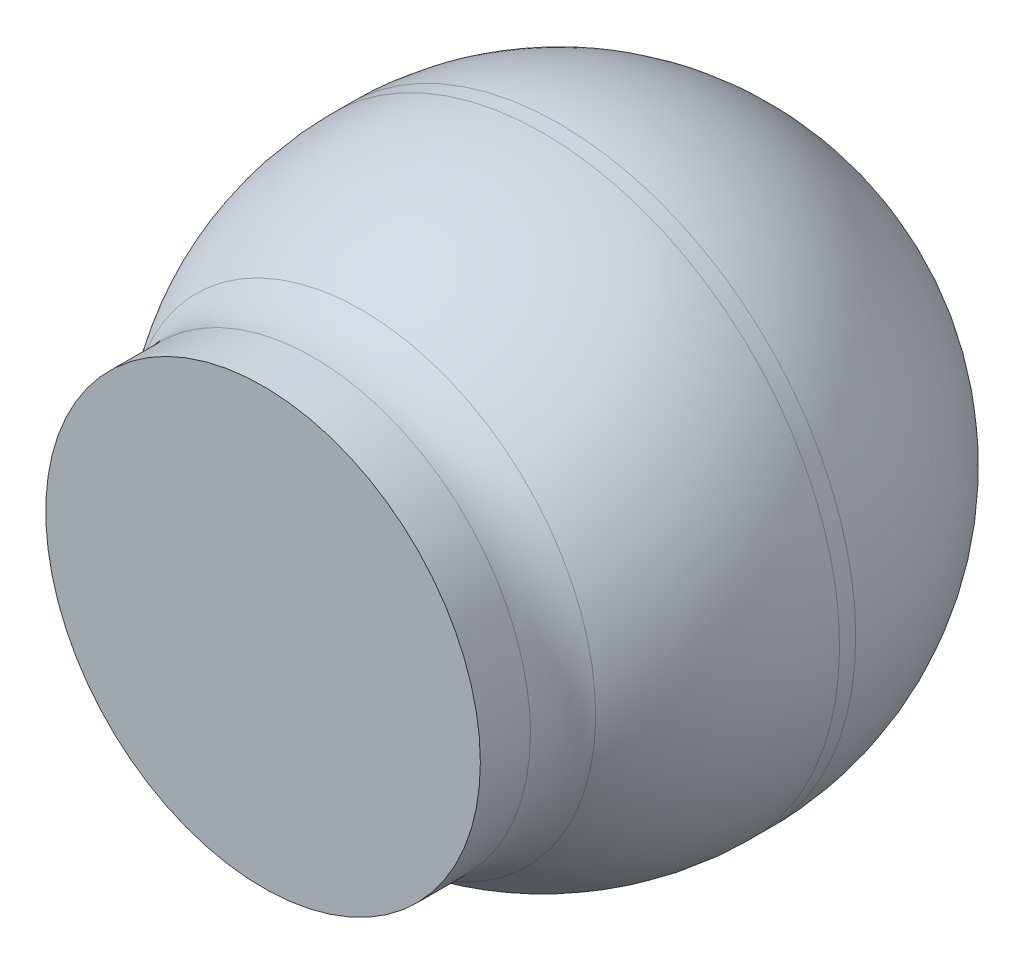
ISO-10303-21;
HEADER;
FILE_DESCRIPTION(('STEP AP214'),'2;1');
FILE_NAME('part.step','',(''),(''),'','','');
FILE_SCHEMA(('AUTOMOTIVE_DESIGN { 1 0 10303 214 1 1 1 1 }'));
ENDSEC;
DATA;
#1=APPLICATION_CONTEXT('core data for automotive mechanical design processes');
#2=APPLICATION_PROTOCOL_DEFINITION('international standard','automotive_design',2000,#1);
#3=PRODUCT_CONTEXT('',#1,'mechanical');
#4=PRODUCT('Part','Part','',(#3));
#5=PRODUCT_RELATED_PRODUCT_CATEGORY('part','',(#4));
#6=PRODUCT_DEFINITION_FORMATION('','',#4);
#7=PRODUCT_DEFINITION_CONTEXT('part definition',#1,'design');
#8=PRODUCT_DEFINITION('design','',#6,#7);
#9=PRODUCT_DEFINITION_SHAPE('','',#8);
#10=(LENGTH_UNIT() NAMED_UNIT(*) SI_UNIT(.MILLI.,.METRE.));
#11=(NAMED_UNIT(*) PLANE_ANGLE_UNIT() SI_UNIT($,.RADIAN.));
#12=(NAMED_UNIT(*) SI_UNIT($,.STERADIAN.) SOLID_ANGLE_UNIT());
#13=UNCERTAINTY_MEASURE_WITH_UNIT(LENGTH_MEASURE(1.E-05),#10,'distance_accuracy_value','');
#14=(GEOMETRIC_REPRESENTATION_CONTEXT(3) GLOBAL_UNCERTAINTY_ASSIGNED_CONTEXT((#13)) GLOBAL_UNIT_ASSIGNED_CONTEXT((#10,
#11,#12)) REPRESENTATION_CONTEXT('',''));
#15=CARTESIAN_POINT('',(0.,0.,0.));
#16=DIRECTION('',(0.,0.,1.));
#17=DIRECTION('',(1.,0.,0.));
#18=AXIS2_PLACEMENT_3D('',#15,#16,#17);
#19=CARTESIAN_POINT('',(-8.182919922269,-4.051349291452,10.006534503384));
#20=DIRECTION('',(0.,0.,-1.));
#21=DIRECTION('',(-1.,0.,0.));
#22=AXIS2_PLACEMENT_3D('',#19,#20,#21);
#23=PLANE('',#22);
#24=CARTESIAN_POINT('',(-8.182919922269,-4.051349291452,10.006534503384));
#25=DIRECTION('',(0.,0.,1.));
#26=DIRECTION('',(1.,0.,0.));
#27=AXIS2_PLACEMENT_3D('',#24,#25,#26);
#28=CIRCLE('',#27,0.275);
#29=CARTESIAN_POINT('',(-7.907919922269,-4.051349291452,10.006534503384));
#30=VERTEX_POINT('',#29);
#31=EDGE_CURVE('E20',#30,#30,#28,.F.);
#32=ORIENTED_EDGE('',*,*,#31,.F.);
#33=EDGE_LOOP('',(#32));
#34=FACE_BOUND('',#33,.T.);
#35=ADVANCED_FACE('F17',(#34),#23,.F.);
#36=CARTESIAN_POINT('',(-8.182919922269,-4.051349291452,9.906534503384));
#37=DIRECTION('',(0.,0.,1.));
#38=DIRECTION('',(1.,0.,0.));
#39=AXIS2_PLACEMENT_3D('',#36,#37,#38);
#40=CYLINDRICAL_SURFACE('',#39,0.275);
#41=CARTESIAN_POINT('',(-8.182919922269,-4.051349291452,9.943180457728));
#42=DIRECTION('',(0.,0.,-1.));
#43=DIRECTION('',(0.996700902337583,0.0811622527992436,0.));
#44=AXIS2_PLACEMENT_3D('',#41,#42,#43);
#45=CIRCLE('',#44,0.275000000000001);
#46=CARTESIAN_POINT('',(-7.90882717412616,-4.02902967193221,9.943180457728));
#47=VERTEX_POINT('',#46);
#48=EDGE_CURVE('E65',#47,#47,#45,.F.);
#49=ORIENTED_EDGE('',*,*,#48,.T.);
#50=EDGE_LOOP('',(#49));
#51=FACE_BOUND('',#50,.T.);
#52=ORIENTED_EDGE('',*,*,#31,.T.);
#53=EDGE_LOOP('',(#52));
#54=FACE_BOUND('',#53,.T.);
#55=ADVANCED_FACE('F62',(#51,#54),#40,.T.);
#56=CARTESIAN_POINT('',(-8.182919922269,-4.051349291452,9.943180457728));
#57=DIRECTION('',(0.,0.,-1.));
#58=DIRECTION('',(0.996700902337583,0.0811622527992448,0.));
#59=AXIS2_PLACEMENT_3D('',#56,#57,#58);
#60=TOROIDAL_SURFACE('',#59,0.375,0.1);
#61=ORIENTED_EDGE('',*,*,#48,.F.);
#62=EDGE_LOOP('',(#61));
#63=FACE_BOUND('',#62,.T.);
#64=CARTESIAN_POINT('',(-8.182919922269,-4.051349291452,9.881744931236));
#65=DIRECTION('',(0.,0.,-1.));
#66=DIRECTION('',(-0.996700902337598,-0.0811622527990598,0.));
#67=AXIS2_PLACEMENT_3D('',#64,#65,#66);
#68=CIRCLE('',#67,0.296097046412663);
#69=CARTESIAN_POINT('',(-8.478040115608,-4.075381194786,9.881744931236));
#70=VERTEX_POINT('',#69);
#71=EDGE_CURVE('E39',#70,#70,#68,.T.);
#72=ORIENTED_EDGE('',*,*,#71,.F.);
#73=EDGE_LOOP('',(#72));
#74=FACE_BOUND('',#73,.T.);
#75=ADVANCED_FACE('F57',(#63,#74),#60,.F.);
#76=CARTESIAN_POINT('',(-8.556682760645,-4.081785136252,9.651976062157));
#77=CARTESIAN_POINT('',(-8.556682760645,-4.081785136252,9.701461392103));
#78=CARTESIAN_POINT('',(-8.548526217348,-4.081120941579,9.750947004335));
#79=CARTESIAN_POINT('',(-8.532207085349,-4.079792059952,9.798626332798));
#80=CARTESIAN_POINT('',(-8.508341390838,-4.077848654938,9.842699544317));
#81=CARTESIAN_POINT('',(-8.478040115608,-4.075381194786,9.881744931236));
#82=(BOUNDED_CURVE() B_SPLINE_CURVE(5,(#76,#77,#78,#79,#80,#81),.UNSPECIFIED.,.F.,
.F.) B_SPLINE_CURVE_WITH_KNOTS((6,6),(0.,0.661568582165),
.UNSPECIFIED.) CURVE() GEOMETRIC_REPRESENTATION_ITEM() RATIONAL_B_SPLINE_CURVE((1.,1.,1.,1.,1.,1.)) REPRESENTATION_ITEM(''));
#83=CARTESIAN_POINT('',(-8.182919922269,-4.051349291452,9.651976062157));
#84=DIRECTION('',(0.,0.,-1.));
#85=AXIS1_PLACEMENT('',#83,#84);
#86=SURFACE_OF_REVOLUTION('',#82,#85);
#87=CARTESIAN_POINT('',(-8.182919922269,-4.051349291452,9.651976062157));
#88=DIRECTION('',(0.,0.,1.));
#89=DIRECTION('',(1.,0.,0.));
#90=AXIS2_PLACEMENT_3D('',#87,#88,#89);
#91=CIRCLE('',#90,0.375);
#92=CARTESIAN_POINT('',(-7.807919922269,-4.051349291452,9.651976062157));
#93=VERTEX_POINT('',#92);
#94=EDGE_CURVE('E36',#93,#93,#91,.F.);
#95=ORIENTED_EDGE('',*,*,#94,.F.);
#96=EDGE_LOOP('',(#95));
#97=FACE_BOUND('',#96,.T.);
#98=ORIENTED_EDGE('',*,*,#71,.T.);
#99=EDGE_LOOP('',(#98));
#100=FACE_BOUND('',#99,.T.);
#101=ADVANCED_FACE('F53',(#97,#100),#86,.F.);
#102=CARTESIAN_POINT('',(-8.182919922269,-4.051349291452,9.256534503384));
#103=DIRECTION('',(0.,0.,1.));
#104=DIRECTION('',(1.,0.,0.));
#105=AXIS2_PLACEMENT_3D('',#102,#103,#104);
#106=CYLINDRICAL_SURFACE('',#105,0.375);
#107=CARTESIAN_POINT('',(-8.182919922269,-4.051349291452,9.631534503384));
#108=DIRECTION('',(0.,0.,-1.));
#109=DIRECTION('',(0.0811622527992357,-0.996700902337583,0.));
#110=AXIS2_PLACEMENT_3D('',#107,#108,#109);
#111=CIRCLE('',#110,0.375);
#112=CARTESIAN_POINT('',(-8.15248407746929,-4.42511212982859,9.631534503384));
#113=VERTEX_POINT('',#112);
#114=CARTESIAN_POINT('',(-8.21335576706871,-3.67758645307541,9.631534503384));
#115=VERTEX_POINT('',#114);
#116=EDGE_CURVE('E11',#113,#115,#111,.T.);
#117=ORIENTED_EDGE('',*,*,#116,.F.);
#118=CARTESIAN_POINT('',(-8.182919922269,-4.051349291452,9.631534503384));
#119=DIRECTION('',(0.,0.,1.));
#120=DIRECTION('',(0.0811622527992365,-0.996700902337583,0.));
#121=AXIS2_PLACEMENT_3D('',#118,#119,#120);
#122=CIRCLE('',#121,0.375);
#123=EDGE_CURVE('E25',#115,#113,#122,.F.);
#124=ORIENTED_EDGE('',*,*,#123,.F.);
#125=EDGE_LOOP('',(#117,#124));
#126=FACE_BOUND('',#125,.T.);
#127=ORIENTED_EDGE('',*,*,#94,.T.);
#128=EDGE_LOOP('',(#127));
#129=FACE_BOUND('',#128,.T.);
#130=ADVANCED_FACE('F34',(#126,#129),#106,.T.);
#131=CARTESIAN_POINT('',(-8.182919922269,-4.051349291452,9.631534503384));
#132=DIRECTION('',(0.0811622527992361,-0.996700902337583,0.));
#133=DIRECTION('',(-0.996700902337583,-0.0811622527992361,0.));
#134=AXIS2_PLACEMENT_3D('',#131,#132,#133);
#135=SPHERICAL_SURFACE('',#134,0.375);
#136=ORIENTED_EDGE('',*,*,#123,.T.);
#137=ORIENTED_EDGE('',*,*,#116,.T.);
#138=EDGE_LOOP('',(#136,#137));
#139=FACE_BOUND('',#138,.T.);
#140=ADVANCED_FACE('F32',(#139),#135,.T.);
#141=CLOSED_SHELL('',(#35,#55,#75,#101,#130,#140));
#142=MANIFOLD_SOLID_BREP('B1',#141);
#143=ADVANCED_BREP_SHAPE_REPRESENTATION('',(#18,#142),#14);
#144=SHAPE_DEFINITION_REPRESENTATION(#9,#143);
ENDSEC;
END-ISO-10303-21;
